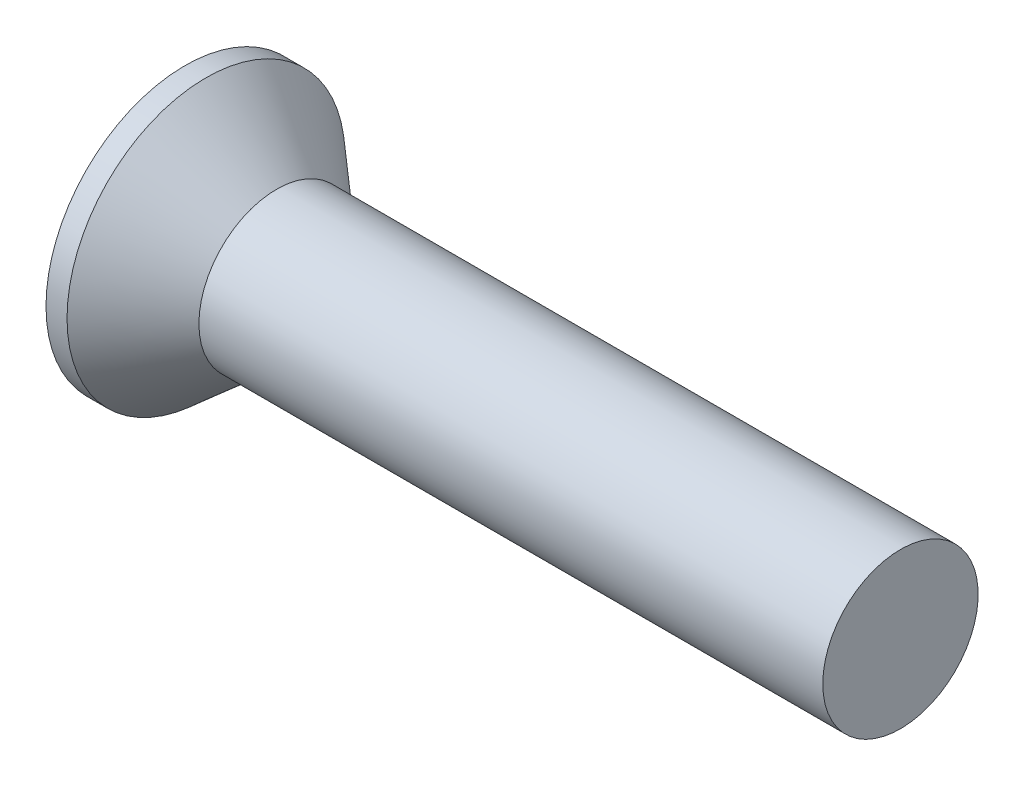
ISO-10303-21;
HEADER;
FILE_DESCRIPTION(('STEP AP214'),'2;1');
FILE_NAME('part.step','',(''),(''),'','','');
FILE_SCHEMA(('AUTOMOTIVE_DESIGN { 1 0 10303 214 1 1 1 1 }'));
ENDSEC;
DATA;
#1=APPLICATION_CONTEXT('core data for automotive mechanical design processes');
#2=APPLICATION_PROTOCOL_DEFINITION('international standard','automotive_design',2000,#1);
#3=PRODUCT_CONTEXT('',#1,'mechanical');
#4=PRODUCT('Part','Part','',(#3));
#5=PRODUCT_RELATED_PRODUCT_CATEGORY('part','',(#4));
#6=PRODUCT_DEFINITION_FORMATION('','',#4);
#7=PRODUCT_DEFINITION_CONTEXT('part definition',#1,'design');
#8=PRODUCT_DEFINITION('design','',#6,#7);
#9=PRODUCT_DEFINITION_SHAPE('','',#8);
#10=(LENGTH_UNIT() NAMED_UNIT(*) SI_UNIT(.MILLI.,.METRE.));
#11=(NAMED_UNIT(*) PLANE_ANGLE_UNIT() SI_UNIT($,.RADIAN.));
#12=(NAMED_UNIT(*) SI_UNIT($,.STERADIAN.) SOLID_ANGLE_UNIT());
#13=UNCERTAINTY_MEASURE_WITH_UNIT(LENGTH_MEASURE(1.E-05),#10,'distance_accuracy_value','');
#14=(GEOMETRIC_REPRESENTATION_CONTEXT(3) GLOBAL_UNCERTAINTY_ASSIGNED_CONTEXT((#13)) GLOBAL_UNIT_ASSIGNED_CONTEXT((#10,
#11,#12)) REPRESENTATION_CONTEXT('',''));
#15=CARTESIAN_POINT('',(0.,0.,0.));
#16=DIRECTION('',(0.,0.,1.));
#17=DIRECTION('',(1.,0.,0.));
#18=AXIS2_PLACEMENT_3D('',#15,#16,#17);
#19=CARTESIAN_POINT('',(0.,0.,0.));
#20=DIRECTION('',(-1.,0.,0.));
#21=DIRECTION('',(0.,0.,1.));
#22=AXIS2_PLACEMENT_3D('',#19,#20,#21);
#23=PLANE('',#22);
#24=CARTESIAN_POINT('',(0.,0.,0.));
#25=DIRECTION('',(-1.,0.,0.));
#26=DIRECTION('',(0.,0.,1.));
#27=AXIS2_PLACEMENT_3D('',#24,#25,#26);
#28=CIRCLE('',#27,4.318);
#29=CARTESIAN_POINT('',(0.,0.,4.318));
#30=VERTEX_POINT('',#29);
#31=EDGE_CURVE('E10',#30,#30,#28,.T.);
#32=ORIENTED_EDGE('',*,*,#31,.T.);
#33=EDGE_LOOP('',(#32));
#34=FACE_BOUND('',#33,.T.);
#35=ADVANCED_FACE('F37',(#34),#23,.T.);
#36=CARTESIAN_POINT('',(-6.34999999999999,0.,0.));
#37=DIRECTION('',(-1.,0.,0.));
#38=DIRECTION('',(0.,0.,1.));
#39=AXIS2_PLACEMENT_3D('',#36,#37,#38);
#40=CYLINDRICAL_SURFACE('',#39,4.318);
#41=CARTESIAN_POINT('',(0.653348184243985,0.,0.));
#42=DIRECTION('',(-1.,0.,0.));
#43=DIRECTION('',(0.,0.,1.));
#44=AXIS2_PLACEMENT_3D('',#41,#42,#43);
#45=CIRCLE('',#44,4.318);
#46=CARTESIAN_POINT('',(0.653348184243985,0.,4.318));
#47=VERTEX_POINT('',#46);
#48=EDGE_CURVE('E43',#47,#47,#45,.T.);
#49=ORIENTED_EDGE('',*,*,#48,.T.);
#50=EDGE_LOOP('',(#49));
#51=FACE_BOUND('',#50,.T.);
#52=ORIENTED_EDGE('',*,*,#31,.F.);
#53=EDGE_LOOP('',(#52));
#54=FACE_BOUND('',#53,.T.);
#55=ADVANCED_FACE('F69',(#51,#54),#40,.T.);
#56=CARTESIAN_POINT('',(0.653348184243985,0.,0.));
#57=DIRECTION('',(-1.,0.,0.));
#58=DIRECTION('',(0.,0.,1.));
#59=AXIS2_PLACEMENT_3D('',#56,#57,#58);
#60=CONICAL_SURFACE('',#59,4.318,0.715584993317677);
#61=CARTESIAN_POINT('',(2.8448,0.,0.));
#62=DIRECTION('',(-1.,0.,0.));
#63=DIRECTION('',(0.,0.,1.));
#64=AXIS2_PLACEMENT_3D('',#61,#62,#63);
#65=CIRCLE('',#64,2.413);
#66=CARTESIAN_POINT('',(2.8448,0.,2.413));
#67=VERTEX_POINT('',#66);
#68=EDGE_CURVE('E47',#67,#67,#65,.T.);
#69=ORIENTED_EDGE('',*,*,#68,.T.);
#70=EDGE_LOOP('',(#69));
#71=FACE_BOUND('',#70,.T.);
#72=ORIENTED_EDGE('',*,*,#48,.F.);
#73=EDGE_LOOP('',(#72));
#74=FACE_BOUND('',#73,.T.);
#75=ADVANCED_FACE('F66',(#71,#74),#60,.T.);
#76=CARTESIAN_POINT('',(-6.34999999999999,0.,0.));
#77=DIRECTION('',(-1.,0.,0.));
#78=DIRECTION('',(0.,0.,1.));
#79=AXIS2_PLACEMENT_3D('',#76,#77,#78);
#80=CYLINDRICAL_SURFACE('',#79,2.413);
#81=CARTESIAN_POINT('',(22.225,0.,0.));
#82=DIRECTION('',(-1.,0.,0.));
#83=DIRECTION('',(0.,0.,1.));
#84=AXIS2_PLACEMENT_3D('',#81,#82,#83);
#85=CIRCLE('',#84,2.413);
#86=CARTESIAN_POINT('',(22.225,0.,2.413));
#87=VERTEX_POINT('',#86);
#88=EDGE_CURVE('E51',#87,#87,#85,.T.);
#89=ORIENTED_EDGE('',*,*,#88,.T.);
#90=EDGE_LOOP('',(#89));
#91=FACE_BOUND('',#90,.T.);
#92=ORIENTED_EDGE('',*,*,#68,.F.);
#93=EDGE_LOOP('',(#92));
#94=FACE_BOUND('',#93,.T.);
#95=ADVANCED_FACE('F57',(#91,#94),#80,.T.);
#96=CARTESIAN_POINT('',(22.225,2.413,0.));
#97=DIRECTION('',(1.,0.,0.));
#98=DIRECTION('',(0.,0.,-1.));
#99=AXIS2_PLACEMENT_3D('',#96,#97,#98);
#100=PLANE('',#99);
#101=ORIENTED_EDGE('',*,*,#88,.F.);
#102=EDGE_LOOP('',(#101));
#103=FACE_BOUND('',#102,.T.);
#104=ADVANCED_FACE('F60',(#103),#100,.T.);
#105=CLOSED_SHELL('',(#35,#55,#75,#95,#104));
#106=MANIFOLD_SOLID_BREP('B2',#105);
#107=ADVANCED_BREP_SHAPE_REPRESENTATION('',(#18,#106),#14);
#108=SHAPE_DEFINITION_REPRESENTATION(#9,#107);
ENDSEC;
END-ISO-10303-21;
